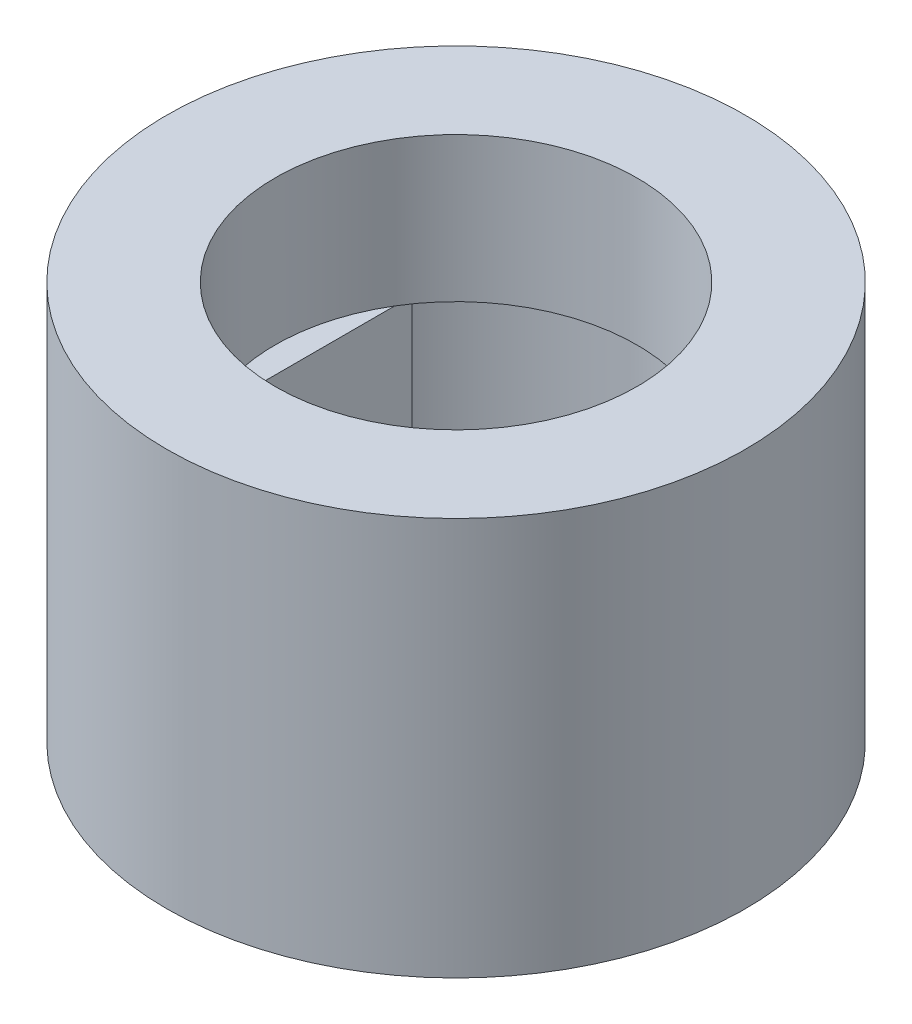
ISO-10303-21;
HEADER;
FILE_DESCRIPTION(('STEP AP214'),'2;1');
FILE_NAME('part.step','',(''),(''),'','','');
FILE_SCHEMA(('AUTOMOTIVE_DESIGN { 1 0 10303 214 1 1 1 1 }'));
ENDSEC;
DATA;
#1=APPLICATION_CONTEXT('core data for automotive mechanical design processes');
#2=APPLICATION_PROTOCOL_DEFINITION('international standard','automotive_design',2000,#1);
#3=PRODUCT_CONTEXT('',#1,'mechanical');
#4=PRODUCT('Part','Part','',(#3));
#5=PRODUCT_RELATED_PRODUCT_CATEGORY('part','',(#4));
#6=PRODUCT_DEFINITION_FORMATION('','',#4);
#7=PRODUCT_DEFINITION_CONTEXT('part definition',#1,'design');
#8=PRODUCT_DEFINITION('design','',#6,#7);
#9=PRODUCT_DEFINITION_SHAPE('','',#8);
#10=(LENGTH_UNIT() NAMED_UNIT(*) SI_UNIT(.MILLI.,.METRE.));
#11=(NAMED_UNIT(*) PLANE_ANGLE_UNIT() SI_UNIT($,.RADIAN.));
#12=(NAMED_UNIT(*) SI_UNIT($,.STERADIAN.) SOLID_ANGLE_UNIT());
#13=UNCERTAINTY_MEASURE_WITH_UNIT(LENGTH_MEASURE(1.E-05),#10,'distance_accuracy_value','');
#14=(GEOMETRIC_REPRESENTATION_CONTEXT(3) GLOBAL_UNCERTAINTY_ASSIGNED_CONTEXT((#13)) GLOBAL_UNIT_ASSIGNED_CONTEXT((#10,
#11,#12)) REPRESENTATION_CONTEXT('',''));
#15=CARTESIAN_POINT('',(0.,0.,0.));
#16=DIRECTION('',(0.,0.,1.));
#17=DIRECTION('',(1.,0.,0.));
#18=AXIS2_PLACEMENT_3D('',#15,#16,#17);
#19=CARTESIAN_POINT('',(0.,0.,0.));
#20=DIRECTION('',(0.,1.,0.));
#21=DIRECTION('',(0.,0.,1.));
#22=AXIS2_PLACEMENT_3D('',#19,#20,#21);
#23=PLANE('',#22);
#24=CARTESIAN_POINT('',(0.,0.,0.));
#25=DIRECTION('',(0.,1.,0.));
#26=DIRECTION('',(0.,0.,1.));
#27=AXIS2_PLACEMENT_3D('',#24,#25,#26);
#28=CIRCLE('',#27,5.08);
#29=CARTESIAN_POINT('',(0.,0.,5.08));
#30=VERTEX_POINT('',#29);
#31=EDGE_CURVE('E43',#30,#30,#28,.T.);
#32=ORIENTED_EDGE('',*,*,#31,.F.);
#33=EDGE_LOOP('',(#32));
#34=FACE_BOUND('',#33,.T.);
#35=CARTESIAN_POINT('',(0.,0.,0.));
#36=DIRECTION('',(0.,1.,0.));
#37=DIRECTION('',(0.,0.,1.));
#38=AXIS2_PLACEMENT_3D('',#35,#36,#37);
#39=CIRCLE('',#38,3.3401);
#40=CARTESIAN_POINT('',(-2.7178,0.,1.94160530747111));
#41=VERTEX_POINT('',#40);
#42=CARTESIAN_POINT('',(-2.7178,0.,-1.94160530747111));
#43=VERTEX_POINT('',#42);
#44=EDGE_CURVE('E62',#41,#43,#39,.T.);
#45=ORIENTED_EDGE('',*,*,#44,.T.);
#46=DIRECTION('',(0.,0.,-1.));
#47=VECTOR('',#46,1.);
#48=CARTESIAN_POINT('',(-2.7178,0.,0.));
#49=LINE('',#48,#47);
#50=EDGE_CURVE('E109',#41,#43,#49,.T.);
#51=ORIENTED_EDGE('',*,*,#50,.F.);
#52=EDGE_LOOP('',(#45,#51));
#53=FACE_BOUND('',#52,.T.);
#54=ADVANCED_FACE('F39',(#34,#53),#23,.F.);
#55=CARTESIAN_POINT('',(0.,6.985,0.));
#56=DIRECTION('',(0.,-1.,0.));
#57=DIRECTION('',(0.,0.,-1.));
#58=AXIS2_PLACEMENT_3D('',#55,#56,#57);
#59=CYLINDRICAL_SURFACE('',#58,5.08);
#60=CARTESIAN_POINT('',(0.,6.985,0.));
#61=DIRECTION('',(0.,1.,0.));
#62=DIRECTION('',(0.,0.,1.));
#63=AXIS2_PLACEMENT_3D('',#60,#61,#62);
#64=CIRCLE('',#63,5.08);
#65=CARTESIAN_POINT('',(0.,6.985,5.08));
#66=VERTEX_POINT('',#65);
#67=EDGE_CURVE('E11',#66,#66,#64,.T.);
#68=ORIENTED_EDGE('',*,*,#67,.F.);
#69=EDGE_LOOP('',(#68));
#70=FACE_BOUND('',#69,.T.);
#71=ORIENTED_EDGE('',*,*,#31,.T.);
#72=EDGE_LOOP('',(#71));
#73=FACE_BOUND('',#72,.T.);
#74=ADVANCED_FACE('F41',(#70,#73),#59,.T.);
#75=CARTESIAN_POINT('',(0.,6.985,0.));
#76=DIRECTION('',(0.,1.,0.));
#77=DIRECTION('',(0.,0.,1.));
#78=AXIS2_PLACEMENT_3D('',#75,#76,#77);
#79=PLANE('',#78);
#80=CARTESIAN_POINT('',(0.,6.985,0.));
#81=DIRECTION('',(0.,1.,0.));
#82=DIRECTION('',(0.,0.,1.));
#83=AXIS2_PLACEMENT_3D('',#80,#81,#82);
#84=CIRCLE('',#83,3.175);
#85=CARTESIAN_POINT('',(0.,6.985,3.175));
#86=VERTEX_POINT('',#85);
#87=EDGE_CURVE('E80',#86,#86,#84,.T.);
#88=ORIENTED_EDGE('',*,*,#87,.F.);
#89=EDGE_LOOP('',(#88));
#90=FACE_BOUND('',#89,.T.);
#91=ORIENTED_EDGE('',*,*,#67,.T.);
#92=EDGE_LOOP('',(#91));
#93=FACE_BOUND('',#92,.T.);
#94=ADVANCED_FACE('F117',(#90,#93),#79,.T.);
#95=CARTESIAN_POINT('',(0.,4.445,0.));
#96=DIRECTION('',(0.,-1.,0.));
#97=DIRECTION('',(0.,0.,-1.));
#98=AXIS2_PLACEMENT_3D('',#95,#96,#97);
#99=CYLINDRICAL_SURFACE('',#98,3.3401);
#100=ORIENTED_EDGE('',*,*,#44,.F.);
#101=DIRECTION('',(0.,-1.,0.));
#102=VECTOR('',#101,1.);
#103=CARTESIAN_POINT('',(-2.7178,4.445,1.94160530747111));
#104=LINE('',#103,#102);
#105=CARTESIAN_POINT('',(-2.7178,4.445,1.94160530747111));
#106=VERTEX_POINT('',#105);
#107=EDGE_CURVE('E101',#106,#41,#104,.T.);
#108=ORIENTED_EDGE('',*,*,#107,.F.);
#109=CARTESIAN_POINT('',(0.,4.445,0.));
#110=DIRECTION('',(0.,1.,0.));
#111=DIRECTION('',(0.,0.,1.));
#112=AXIS2_PLACEMENT_3D('',#109,#110,#111);
#113=CIRCLE('',#112,3.3401);
#114=CARTESIAN_POINT('',(-2.7178,4.445,-1.94160530747111));
#115=VERTEX_POINT('',#114);
#116=EDGE_CURVE('E99',#106,#115,#113,.T.);
#117=ORIENTED_EDGE('',*,*,#116,.T.);
#118=DIRECTION('',(0.,-1.,0.));
#119=VECTOR('',#118,1.);
#120=CARTESIAN_POINT('',(-2.7178,4.445,-1.94160530747111));
#121=LINE('',#120,#119);
#122=EDGE_CURVE('E103',#115,#43,#121,.T.);
#123=ORIENTED_EDGE('',*,*,#122,.T.);
#124=EDGE_LOOP('',(#100,#108,#117,#123));
#125=FACE_BOUND('',#124,.T.);
#126=ADVANCED_FACE('F120',(#125),#99,.F.);
#127=CARTESIAN_POINT('',(-2.7178,4.445,0.));
#128=DIRECTION('',(-1.,0.,0.));
#129=DIRECTION('',(0.,0.,1.));
#130=AXIS2_PLACEMENT_3D('',#127,#128,#129);
#131=PLANE('',#130);
#132=ORIENTED_EDGE('',*,*,#50,.T.);
#133=ORIENTED_EDGE('',*,*,#122,.F.);
#134=DIRECTION('',(0.,0.,-1.));
#135=VECTOR('',#134,1.);
#136=CARTESIAN_POINT('',(-2.7178,4.445,0.));
#137=LINE('',#136,#135);
#138=CARTESIAN_POINT('',(-2.7178,4.445,-1.6413982332146));
#139=VERTEX_POINT('',#138);
#140=EDGE_CURVE('E93',#139,#115,#137,.T.);
#141=ORIENTED_EDGE('',*,*,#140,.F.);
#142=CARTESIAN_POINT('',(-2.7178,4.445,1.6413982332146));
#143=VERTEX_POINT('',#142);
#144=EDGE_CURVE('E85',#143,#139,#137,.T.);
#145=ORIENTED_EDGE('',*,*,#144,.F.);
#146=EDGE_CURVE('E91',#106,#143,#137,.T.);
#147=ORIENTED_EDGE('',*,*,#146,.F.);
#148=ORIENTED_EDGE('',*,*,#107,.T.);
#149=EDGE_LOOP('',(#132,#133,#141,#145,#147,#148));
#150=FACE_BOUND('',#149,.T.);
#151=ADVANCED_FACE('F90',(#150),#131,.F.);
#152=CARTESIAN_POINT('',(0.,4.445,0.));
#153=DIRECTION('',(0.,1.,0.));
#154=DIRECTION('',(0.,0.,1.));
#155=AXIS2_PLACEMENT_3D('',#152,#153,#154);
#156=PLANE('',#155);
#157=ORIENTED_EDGE('',*,*,#146,.T.);
#158=CARTESIAN_POINT('',(0.,4.445,0.));
#159=DIRECTION('',(0.,1.,0.));
#160=DIRECTION('',(0.,0.,1.));
#161=AXIS2_PLACEMENT_3D('',#158,#159,#160);
#162=CIRCLE('',#161,3.175);
#163=EDGE_CURVE('E73',#143,#139,#162,.T.);
#164=ORIENTED_EDGE('',*,*,#163,.T.);
#165=ORIENTED_EDGE('',*,*,#140,.T.);
#166=ORIENTED_EDGE('',*,*,#116,.F.);
#167=EDGE_LOOP('',(#157,#164,#165,#166));
#168=FACE_BOUND('',#167,.T.);
#169=ADVANCED_FACE('F97',(#168),#156,.F.);
#170=CARTESIAN_POINT('',(0.,4.445,0.));
#171=DIRECTION('',(0.,1.,0.));
#172=DIRECTION('',(0.,0.,1.));
#173=AXIS2_PLACEMENT_3D('',#170,#171,#172);
#174=PLANE('',#173);
#175=ORIENTED_EDGE('',*,*,#144,.T.);
#176=EDGE_CURVE('E54',#139,#143,#162,.T.);
#177=ORIENTED_EDGE('',*,*,#176,.T.);
#178=EDGE_LOOP('',(#175,#177));
#179=FACE_BOUND('',#178,.T.);
#180=ADVANCED_FACE('F84',(#179),#174,.T.);
#181=CARTESIAN_POINT('',(0.,4.445,0.));
#182=DIRECTION('',(0.,1.,0.));
#183=DIRECTION('',(0.,0.,1.));
#184=AXIS2_PLACEMENT_3D('',#181,#182,#183);
#185=CYLINDRICAL_SURFACE('',#184,3.175);
#186=ORIENTED_EDGE('',*,*,#176,.F.);
#187=ORIENTED_EDGE('',*,*,#163,.F.);
#188=EDGE_LOOP('',(#186,#187));
#189=FACE_BOUND('',#188,.T.);
#190=ORIENTED_EDGE('',*,*,#87,.T.);
#191=EDGE_LOOP('',(#190));
#192=FACE_BOUND('',#191,.T.);
#193=ADVANCED_FACE('F74',(#189,#192),#185,.F.);
#194=CLOSED_SHELL('',(#54,#74,#94,#126,#151,#169,#180,#193));
#195=MANIFOLD_SOLID_BREP('B2',#194);
#196=ADVANCED_BREP_SHAPE_REPRESENTATION('',(#18,#195),#14);
#197=SHAPE_DEFINITION_REPRESENTATION(#9,#196);
ENDSEC;
END-ISO-10303-21;
